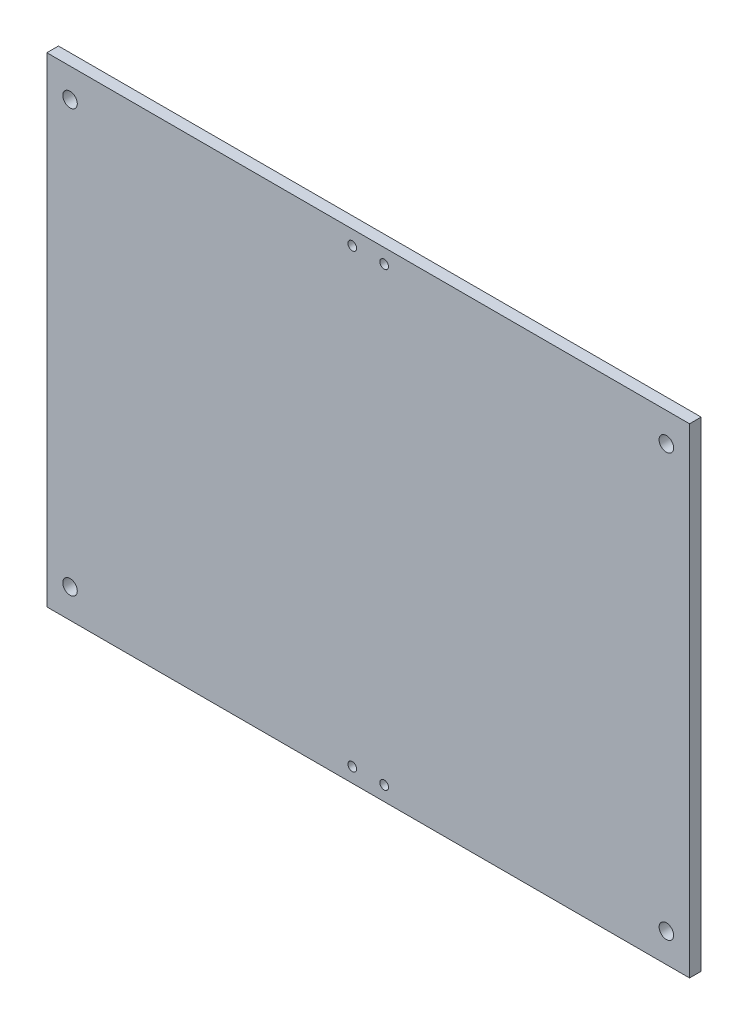
ISO-10303-21;
HEADER;
FILE_DESCRIPTION(('STEP AP214'),'2;1');
FILE_NAME('part.step','',(''),(''),'','','');
FILE_SCHEMA(('AUTOMOTIVE_DESIGN { 1 0 10303 214 1 1 1 1 }'));
ENDSEC;
DATA;
#1=APPLICATION_CONTEXT('core data for automotive mechanical design processes');
#2=APPLICATION_PROTOCOL_DEFINITION('international standard','automotive_design',2000,#1);
#3=PRODUCT_CONTEXT('',#1,'mechanical');
#4=PRODUCT('Part','Part','',(#3));
#5=PRODUCT_RELATED_PRODUCT_CATEGORY('part','',(#4));
#6=PRODUCT_DEFINITION_FORMATION('','',#4);
#7=PRODUCT_DEFINITION_CONTEXT('part definition',#1,'design');
#8=PRODUCT_DEFINITION('design','',#6,#7);
#9=PRODUCT_DEFINITION_SHAPE('','',#8);
#10=(LENGTH_UNIT() NAMED_UNIT(*) SI_UNIT(.MILLI.,.METRE.));
#11=(NAMED_UNIT(*) PLANE_ANGLE_UNIT() SI_UNIT($,.RADIAN.));
#12=(NAMED_UNIT(*) SI_UNIT($,.STERADIAN.) SOLID_ANGLE_UNIT());
#13=UNCERTAINTY_MEASURE_WITH_UNIT(LENGTH_MEASURE(1.E-05),#10,'distance_accuracy_value','');
#14=(GEOMETRIC_REPRESENTATION_CONTEXT(3) GLOBAL_UNCERTAINTY_ASSIGNED_CONTEXT((#13)) GLOBAL_UNIT_ASSIGNED_CONTEXT((#10,
#11,#12)) REPRESENTATION_CONTEXT('',''));
#15=CARTESIAN_POINT('',(0.,0.,0.));
#16=DIRECTION('',(0.,0.,1.));
#17=DIRECTION('',(1.,0.,0.));
#18=AXIS2_PLACEMENT_3D('',#15,#16,#17);
#19=CARTESIAN_POINT('',(389.397540983607,431.475409836066,4.));
#20=DIRECTION('',(1.,0.,0.));
#21=DIRECTION('',(0.,0.,-1.));
#22=AXIS2_PLACEMENT_3D('',#19,#20,#21);
#23=PLANE('',#22);
#24=DIRECTION('',(0.,-1.,0.));
#25=VECTOR('',#24,1.);
#26=CARTESIAN_POINT('',(389.397540983607,431.475409836066,0.));
#27=LINE('',#26,#25);
#28=CARTESIAN_POINT('',(389.397540983607,431.475409836066,0.));
#29=VERTEX_POINT('',#28);
#30=CARTESIAN_POINT('',(389.397540983607,265.865409836066,0.));
#31=VERTEX_POINT('',#30);
#32=EDGE_CURVE('E99',#29,#31,#27,.T.);
#33=ORIENTED_EDGE('',*,*,#32,.T.);
#34=DIRECTION('',(0.,0.,-1.));
#35=VECTOR('',#34,1.);
#36=CARTESIAN_POINT('',(389.397540983607,265.865409836066,4.));
#37=LINE('',#36,#35);
#38=CARTESIAN_POINT('',(389.397540983607,265.865409836066,4.));
#39=VERTEX_POINT('',#38);
#40=EDGE_CURVE('E11',#39,#31,#37,.T.);
#41=ORIENTED_EDGE('',*,*,#40,.F.);
#42=DIRECTION('',(0.,-1.,0.));
#43=VECTOR('',#42,1.);
#44=CARTESIAN_POINT('',(389.397540983607,431.475409836066,4.));
#45=LINE('',#44,#43);
#46=CARTESIAN_POINT('',(389.397540983607,431.475409836066,4.));
#47=VERTEX_POINT('',#46);
#48=EDGE_CURVE('E86',#47,#39,#45,.T.);
#49=ORIENTED_EDGE('',*,*,#48,.F.);
#50=DIRECTION('',(0.,0.,-1.));
#51=VECTOR('',#50,1.);
#52=CARTESIAN_POINT('',(389.397540983607,431.475409836066,4.));
#53=LINE('',#52,#51);
#54=EDGE_CURVE('E95',#47,#29,#53,.T.);
#55=ORIENTED_EDGE('',*,*,#54,.T.);
#56=EDGE_LOOP('',(#33,#41,#49,#55));
#57=FACE_BOUND('',#56,.T.);
#58=ADVANCED_FACE('F33',(#57),#23,.F.);
#59=CARTESIAN_POINT('',(389.397540983607,265.865409836066,4.));
#60=DIRECTION('',(0.,1.,0.));
#61=DIRECTION('',(0.,0.,1.));
#62=AXIS2_PLACEMENT_3D('',#59,#60,#61);
#63=PLANE('',#62);
#64=DIRECTION('',(1.,0.,0.));
#65=VECTOR('',#64,1.);
#66=CARTESIAN_POINT('',(389.397540983607,265.865409836066,0.));
#67=LINE('',#66,#65);
#68=CARTESIAN_POINT('',(611.147540983607,265.865409836066,0.));
#69=VERTEX_POINT('',#68);
#70=EDGE_CURVE('E90',#31,#69,#67,.T.);
#71=ORIENTED_EDGE('',*,*,#70,.T.);
#72=DIRECTION('',(0.,0.,-1.));
#73=VECTOR('',#72,1.);
#74=CARTESIAN_POINT('',(611.147540983607,265.865409836066,4.));
#75=LINE('',#74,#73);
#76=CARTESIAN_POINT('',(611.147540983607,265.865409836066,4.));
#77=VERTEX_POINT('',#76);
#78=EDGE_CURVE('E42',#77,#69,#75,.T.);
#79=ORIENTED_EDGE('',*,*,#78,.F.);
#80=DIRECTION('',(1.,0.,0.));
#81=VECTOR('',#80,1.);
#82=CARTESIAN_POINT('',(389.397540983607,265.865409836066,4.));
#83=LINE('',#82,#81);
#84=EDGE_CURVE('E81',#39,#77,#83,.T.);
#85=ORIENTED_EDGE('',*,*,#84,.F.);
#86=ORIENTED_EDGE('',*,*,#40,.T.);
#87=EDGE_LOOP('',(#71,#79,#85,#86));
#88=FACE_BOUND('',#87,.T.);
#89=ADVANCED_FACE('F89',(#88),#63,.F.);
#90=CARTESIAN_POINT('',(611.147540983607,431.475409836066,4.));
#91=DIRECTION('',(-1.,0.,0.));
#92=DIRECTION('',(0.,-1.,0.));
#93=AXIS2_PLACEMENT_3D('',#90,#91,#92);
#94=PLANE('',#93);
#95=DIRECTION('',(0.,1.,0.));
#96=VECTOR('',#95,1.);
#97=CARTESIAN_POINT('',(611.147540983607,431.475409836066,0.));
#98=LINE('',#97,#96);
#99=CARTESIAN_POINT('',(611.147540983607,431.475409836066,0.));
#100=VERTEX_POINT('',#99);
#101=EDGE_CURVE('E68',#69,#100,#98,.T.);
#102=ORIENTED_EDGE('',*,*,#101,.T.);
#103=DIRECTION('',(0.,0.,-1.));
#104=VECTOR('',#103,1.);
#105=CARTESIAN_POINT('',(611.147540983607,431.475409836066,4.));
#106=LINE('',#105,#104);
#107=CARTESIAN_POINT('',(611.147540983607,431.475409836066,4.));
#108=VERTEX_POINT('',#107);
#109=EDGE_CURVE('E91',#108,#100,#106,.T.);
#110=ORIENTED_EDGE('',*,*,#109,.F.);
#111=DIRECTION('',(0.,1.,0.));
#112=VECTOR('',#111,1.);
#113=CARTESIAN_POINT('',(611.147540983607,431.475409836066,4.));
#114=LINE('',#113,#112);
#115=EDGE_CURVE('E84',#77,#108,#114,.T.);
#116=ORIENTED_EDGE('',*,*,#115,.F.);
#117=ORIENTED_EDGE('',*,*,#78,.T.);
#118=EDGE_LOOP('',(#102,#110,#116,#117));
#119=FACE_BOUND('',#118,.T.);
#120=ADVANCED_FACE('F93',(#119),#94,.F.);
#121=CARTESIAN_POINT('',(389.397540983607,431.475409836066,4.));
#122=DIRECTION('',(0.,-1.,0.));
#123=DIRECTION('',(0.,0.,-1.));
#124=AXIS2_PLACEMENT_3D('',#121,#122,#123);
#125=PLANE('',#124);
#126=DIRECTION('',(-1.,0.,0.));
#127=VECTOR('',#126,1.);
#128=CARTESIAN_POINT('',(389.397540983607,431.475409836066,0.));
#129=LINE('',#128,#127);
#130=EDGE_CURVE('E74',#100,#29,#129,.T.);
#131=ORIENTED_EDGE('',*,*,#130,.T.);
#132=ORIENTED_EDGE('',*,*,#54,.F.);
#133=DIRECTION('',(-1.,0.,0.));
#134=VECTOR('',#133,1.);
#135=CARTESIAN_POINT('',(389.397540983607,431.475409836066,4.));
#136=LINE('',#135,#134);
#137=EDGE_CURVE('E51',#108,#47,#136,.T.);
#138=ORIENTED_EDGE('',*,*,#137,.F.);
#139=ORIENTED_EDGE('',*,*,#109,.T.);
#140=EDGE_LOOP('',(#131,#132,#138,#139));
#141=FACE_BOUND('',#140,.T.);
#142=ADVANCED_FACE('F160',(#141),#125,.F.);
#143=CARTESIAN_POINT('',(0.,0.,4.));
#144=DIRECTION('',(0.,0.,1.));
#145=DIRECTION('',(1.,0.,0.));
#146=AXIS2_PLACEMENT_3D('',#143,#144,#145);
#147=PLANE('',#146);
#148=CARTESIAN_POINT('',(505.772540983607,426.475409836066,4.));
#149=DIRECTION('',(0.,0.,1.));
#150=DIRECTION('',(1.,0.,0.));
#151=AXIS2_PLACEMENT_3D('',#148,#149,#150);
#152=CIRCLE('',#151,1.49999999999997);
#153=CARTESIAN_POINT('',(507.272540983607,426.475409836066,4.));
#154=VERTEX_POINT('',#153);
#155=EDGE_CURVE('E128',#154,#154,#152,.T.);
#156=ORIENTED_EDGE('',*,*,#155,.F.);
#157=EDGE_LOOP('',(#156));
#158=FACE_BOUND('',#157,.T.);
#159=CARTESIAN_POINT('',(494.772540983607,426.475409836066,4.));
#160=DIRECTION('',(0.,0.,1.));
#161=DIRECTION('',(1.,0.,0.));
#162=AXIS2_PLACEMENT_3D('',#159,#160,#161);
#163=CIRCLE('',#162,1.49999999999997);
#164=CARTESIAN_POINT('',(496.272540983607,426.475409836066,4.));
#165=VERTEX_POINT('',#164);
#166=EDGE_CURVE('E118',#165,#165,#163,.T.);
#167=ORIENTED_EDGE('',*,*,#166,.F.);
#168=EDGE_LOOP('',(#167));
#169=FACE_BOUND('',#168,.T.);
#170=CARTESIAN_POINT('',(505.772540983607,270.865409836066,4.));
#171=DIRECTION('',(0.,0.,1.));
#172=DIRECTION('',(1.,0.,0.));
#173=AXIS2_PLACEMENT_3D('',#170,#171,#172);
#174=CIRCLE('',#173,1.49999999999997);
#175=CARTESIAN_POINT('',(507.272540983607,270.865409836066,4.));
#176=VERTEX_POINT('',#175);
#177=EDGE_CURVE('E115',#176,#176,#174,.T.);
#178=ORIENTED_EDGE('',*,*,#177,.F.);
#179=EDGE_LOOP('',(#178));
#180=FACE_BOUND('',#179,.T.);
#181=CARTESIAN_POINT('',(494.772540983607,270.865409836066,4.));
#182=DIRECTION('',(0.,0.,1.));
#183=DIRECTION('',(1.,0.,0.));
#184=AXIS2_PLACEMENT_3D('',#181,#182,#183);
#185=CIRCLE('',#184,1.50000000000008);
#186=CARTESIAN_POINT('',(496.272540983607,270.865409836066,4.));
#187=VERTEX_POINT('',#186);
#188=EDGE_CURVE('E112',#187,#187,#185,.T.);
#189=ORIENTED_EDGE('',*,*,#188,.F.);
#190=EDGE_LOOP('',(#189));
#191=FACE_BOUND('',#190,.T.);
#192=CARTESIAN_POINT('',(397.397540983607,275.865409836066,4.));
#193=DIRECTION('',(0.,0.,1.));
#194=DIRECTION('',(1.,0.,0.));
#195=AXIS2_PLACEMENT_3D('',#192,#193,#194);
#196=CIRCLE('',#195,2.4999999999999);
#197=CARTESIAN_POINT('',(399.897540983607,275.865409836066,4.));
#198=VERTEX_POINT('',#197);
#199=EDGE_CURVE('E111',#198,#198,#196,.T.);
#200=ORIENTED_EDGE('',*,*,#199,.F.);
#201=EDGE_LOOP('',(#200));
#202=FACE_BOUND('',#201,.T.);
#203=CARTESIAN_POINT('',(603.147540983607,275.865409836066,4.));
#204=DIRECTION('',(0.,0.,1.));
#205=DIRECTION('',(1.,0.,0.));
#206=AXIS2_PLACEMENT_3D('',#203,#204,#205);
#207=CIRCLE('',#206,2.49999999999992);
#208=CARTESIAN_POINT('',(605.647540983607,275.865409836066,4.));
#209=VERTEX_POINT('',#208);
#210=EDGE_CURVE('E136',#209,#209,#207,.T.);
#211=ORIENTED_EDGE('',*,*,#210,.F.);
#212=EDGE_LOOP('',(#211));
#213=FACE_BOUND('',#212,.T.);
#214=CARTESIAN_POINT('',(603.147540983607,421.475409836066,4.));
#215=DIRECTION('',(0.,0.,1.));
#216=DIRECTION('',(1.,0.,0.));
#217=AXIS2_PLACEMENT_3D('',#214,#215,#216);
#218=CIRCLE('',#217,2.49999999999992);
#219=CARTESIAN_POINT('',(605.647540983607,421.475409836066,4.));
#220=VERTEX_POINT('',#219);
#221=EDGE_CURVE('E142',#220,#220,#218,.T.);
#222=ORIENTED_EDGE('',*,*,#221,.F.);
#223=EDGE_LOOP('',(#222));
#224=FACE_BOUND('',#223,.T.);
#225=CARTESIAN_POINT('',(397.397540983607,421.475409836066,4.));
#226=DIRECTION('',(0.,0.,1.));
#227=DIRECTION('',(1.,0.,0.));
#228=AXIS2_PLACEMENT_3D('',#225,#226,#227);
#229=CIRCLE('',#228,2.4999999999999);
#230=CARTESIAN_POINT('',(399.897540983607,421.475409836066,4.));
#231=VERTEX_POINT('',#230);
#232=EDGE_CURVE('E148',#231,#231,#229,.T.);
#233=ORIENTED_EDGE('',*,*,#232,.F.);
#234=EDGE_LOOP('',(#233));
#235=FACE_BOUND('',#234,.T.);
#236=ORIENTED_EDGE('',*,*,#48,.T.);
#237=ORIENTED_EDGE('',*,*,#84,.T.);
#238=ORIENTED_EDGE('',*,*,#115,.T.);
#239=ORIENTED_EDGE('',*,*,#137,.T.);
#240=EDGE_LOOP('',(#236,#237,#238,#239));
#241=FACE_BOUND('',#240,.T.);
#242=ADVANCED_FACE('F82',(#158,#169,#180,#191,#202,#213,#224,#235,#241),#147,.T.);
#243=CARTESIAN_POINT('',(0.,0.,0.));
#244=DIRECTION('',(0.,0.,1.));
#245=DIRECTION('',(1.,0.,0.));
#246=AXIS2_PLACEMENT_3D('',#243,#244,#245);
#247=PLANE('',#246);
#248=CARTESIAN_POINT('',(505.772540983607,426.475409836066,0.));
#249=DIRECTION('',(0.,0.,1.));
#250=DIRECTION('',(1.,0.,0.));
#251=AXIS2_PLACEMENT_3D('',#248,#249,#250);
#252=CIRCLE('',#251,1.49999999999997);
#253=CARTESIAN_POINT('',(507.272540983607,426.475409836066,0.));
#254=VERTEX_POINT('',#253);
#255=EDGE_CURVE('E36',#254,#254,#252,.T.);
#256=ORIENTED_EDGE('',*,*,#255,.T.);
#257=EDGE_LOOP('',(#256));
#258=FACE_BOUND('',#257,.T.);
#259=CARTESIAN_POINT('',(494.772540983607,426.475409836066,0.));
#260=DIRECTION('',(0.,0.,1.));
#261=DIRECTION('',(1.,0.,0.));
#262=AXIS2_PLACEMENT_3D('',#259,#260,#261);
#263=CIRCLE('',#262,1.49999999999997);
#264=CARTESIAN_POINT('',(496.272540983607,426.475409836066,0.));
#265=VERTEX_POINT('',#264);
#266=EDGE_CURVE('E116',#265,#265,#263,.T.);
#267=ORIENTED_EDGE('',*,*,#266,.T.);
#268=EDGE_LOOP('',(#267));
#269=FACE_BOUND('',#268,.T.);
#270=CARTESIAN_POINT('',(505.772540983607,270.865409836066,0.));
#271=DIRECTION('',(0.,0.,1.));
#272=DIRECTION('',(1.,0.,0.));
#273=AXIS2_PLACEMENT_3D('',#270,#271,#272);
#274=CIRCLE('',#273,1.49999999999997);
#275=CARTESIAN_POINT('',(507.272540983607,270.865409836066,0.));
#276=VERTEX_POINT('',#275);
#277=EDGE_CURVE('E113',#276,#276,#274,.T.);
#278=ORIENTED_EDGE('',*,*,#277,.T.);
#279=EDGE_LOOP('',(#278));
#280=FACE_BOUND('',#279,.T.);
#281=CARTESIAN_POINT('',(494.772540983607,270.865409836066,0.));
#282=DIRECTION('',(0.,0.,1.));
#283=DIRECTION('',(1.,0.,0.));
#284=AXIS2_PLACEMENT_3D('',#281,#282,#283);
#285=CIRCLE('',#284,1.50000000000008);
#286=CARTESIAN_POINT('',(496.272540983607,270.865409836066,0.));
#287=VERTEX_POINT('',#286);
#288=EDGE_CURVE('E108',#287,#287,#285,.T.);
#289=ORIENTED_EDGE('',*,*,#288,.T.);
#290=EDGE_LOOP('',(#289));
#291=FACE_BOUND('',#290,.T.);
#292=CARTESIAN_POINT('',(397.397540983607,275.865409836066,0.));
#293=DIRECTION('',(0.,0.,1.));
#294=DIRECTION('',(1.,0.,0.));
#295=AXIS2_PLACEMENT_3D('',#292,#293,#294);
#296=CIRCLE('',#295,2.4999999999999);
#297=CARTESIAN_POINT('',(399.897540983607,275.865409836066,0.));
#298=VERTEX_POINT('',#297);
#299=EDGE_CURVE('E133',#298,#298,#296,.T.);
#300=ORIENTED_EDGE('',*,*,#299,.T.);
#301=EDGE_LOOP('',(#300));
#302=FACE_BOUND('',#301,.T.);
#303=CARTESIAN_POINT('',(603.147540983607,275.865409836066,0.));
#304=DIRECTION('',(0.,0.,1.));
#305=DIRECTION('',(1.,0.,0.));
#306=AXIS2_PLACEMENT_3D('',#303,#304,#305);
#307=CIRCLE('',#306,2.49999999999992);
#308=CARTESIAN_POINT('',(605.647540983607,275.865409836066,0.));
#309=VERTEX_POINT('',#308);
#310=EDGE_CURVE('E139',#309,#309,#307,.T.);
#311=ORIENTED_EDGE('',*,*,#310,.T.);
#312=EDGE_LOOP('',(#311));
#313=FACE_BOUND('',#312,.T.);
#314=CARTESIAN_POINT('',(603.147540983607,421.475409836066,0.));
#315=DIRECTION('',(0.,0.,1.));
#316=DIRECTION('',(1.,0.,0.));
#317=AXIS2_PLACEMENT_3D('',#314,#315,#316);
#318=CIRCLE('',#317,2.49999999999992);
#319=CARTESIAN_POINT('',(605.647540983607,421.475409836066,0.));
#320=VERTEX_POINT('',#319);
#321=EDGE_CURVE('E145',#320,#320,#318,.T.);
#322=ORIENTED_EDGE('',*,*,#321,.T.);
#323=EDGE_LOOP('',(#322));
#324=FACE_BOUND('',#323,.T.);
#325=CARTESIAN_POINT('',(397.397540983607,421.475409836066,0.));
#326=DIRECTION('',(0.,0.,1.));
#327=DIRECTION('',(1.,0.,0.));
#328=AXIS2_PLACEMENT_3D('',#325,#326,#327);
#329=CIRCLE('',#328,2.4999999999999);
#330=CARTESIAN_POINT('',(399.897540983607,421.475409836066,0.));
#331=VERTEX_POINT('',#330);
#332=EDGE_CURVE('E102',#331,#331,#329,.T.);
#333=ORIENTED_EDGE('',*,*,#332,.T.);
#334=EDGE_LOOP('',(#333));
#335=FACE_BOUND('',#334,.T.);
#336=ORIENTED_EDGE('',*,*,#32,.F.);
#337=ORIENTED_EDGE('',*,*,#130,.F.);
#338=ORIENTED_EDGE('',*,*,#101,.F.);
#339=ORIENTED_EDGE('',*,*,#70,.F.);
#340=EDGE_LOOP('',(#336,#337,#338,#339));
#341=FACE_BOUND('',#340,.T.);
#342=ADVANCED_FACE('F159',(#258,#269,#280,#291,#302,#313,#324,#335,#341),#247,.F.);
#343=CARTESIAN_POINT('',(397.397540983607,421.475409836066,0.));
#344=DIRECTION('',(0.,0.,1.));
#345=DIRECTION('',(1.,0.,0.));
#346=AXIS2_PLACEMENT_3D('',#343,#344,#345);
#347=CYLINDRICAL_SURFACE('',#346,2.4999999999999);
#348=ORIENTED_EDGE('',*,*,#332,.F.);
#349=EDGE_LOOP('',(#348));
#350=FACE_BOUND('',#349,.T.);
#351=ORIENTED_EDGE('',*,*,#232,.T.);
#352=EDGE_LOOP('',(#351));
#353=FACE_BOUND('',#352,.T.);
#354=ADVANCED_FACE('F156',(#350,#353),#347,.F.);
#355=CARTESIAN_POINT('',(603.147540983607,421.475409836066,0.));
#356=DIRECTION('',(0.,0.,1.));
#357=DIRECTION('',(1.,0.,0.));
#358=AXIS2_PLACEMENT_3D('',#355,#356,#357);
#359=CYLINDRICAL_SURFACE('',#358,2.49999999999992);
#360=ORIENTED_EDGE('',*,*,#321,.F.);
#361=EDGE_LOOP('',(#360));
#362=FACE_BOUND('',#361,.T.);
#363=ORIENTED_EDGE('',*,*,#221,.T.);
#364=EDGE_LOOP('',(#363));
#365=FACE_BOUND('',#364,.T.);
#366=ADVANCED_FACE('F200',(#362,#365),#359,.F.);
#367=CARTESIAN_POINT('',(603.147540983607,275.865409836066,0.));
#368=DIRECTION('',(0.,0.,1.));
#369=DIRECTION('',(1.,0.,0.));
#370=AXIS2_PLACEMENT_3D('',#367,#368,#369);
#371=CYLINDRICAL_SURFACE('',#370,2.49999999999992);
#372=ORIENTED_EDGE('',*,*,#310,.F.);
#373=EDGE_LOOP('',(#372));
#374=FACE_BOUND('',#373,.T.);
#375=ORIENTED_EDGE('',*,*,#210,.T.);
#376=EDGE_LOOP('',(#375));
#377=FACE_BOUND('',#376,.T.);
#378=ADVANCED_FACE('F210',(#374,#377),#371,.F.);
#379=CARTESIAN_POINT('',(397.397540983607,275.865409836066,0.));
#380=DIRECTION('',(0.,0.,1.));
#381=DIRECTION('',(1.,0.,0.));
#382=AXIS2_PLACEMENT_3D('',#379,#380,#381);
#383=CYLINDRICAL_SURFACE('',#382,2.4999999999999);
#384=ORIENTED_EDGE('',*,*,#299,.F.);
#385=EDGE_LOOP('',(#384));
#386=FACE_BOUND('',#385,.T.);
#387=ORIENTED_EDGE('',*,*,#199,.T.);
#388=EDGE_LOOP('',(#387));
#389=FACE_BOUND('',#388,.T.);
#390=ADVANCED_FACE('F220',(#386,#389),#383,.F.);
#391=CARTESIAN_POINT('',(494.772540983607,270.865409836066,-6.));
#392=DIRECTION('',(0.,0.,1.));
#393=DIRECTION('',(1.,0.,0.));
#394=AXIS2_PLACEMENT_3D('',#391,#392,#393);
#395=CYLINDRICAL_SURFACE('',#394,1.50000000000008);
#396=ORIENTED_EDGE('',*,*,#188,.T.);
#397=EDGE_LOOP('',(#396));
#398=FACE_BOUND('',#397,.T.);
#399=ORIENTED_EDGE('',*,*,#288,.F.);
#400=EDGE_LOOP('',(#399));
#401=FACE_BOUND('',#400,.T.);
#402=ADVANCED_FACE('F229',(#398,#401),#395,.F.);
#403=CARTESIAN_POINT('',(505.772540983607,270.865409836066,-6.));
#404=DIRECTION('',(0.,0.,1.));
#405=DIRECTION('',(1.,0.,0.));
#406=AXIS2_PLACEMENT_3D('',#403,#404,#405);
#407=CYLINDRICAL_SURFACE('',#406,1.49999999999997);
#408=ORIENTED_EDGE('',*,*,#177,.T.);
#409=EDGE_LOOP('',(#408));
#410=FACE_BOUND('',#409,.T.);
#411=ORIENTED_EDGE('',*,*,#277,.F.);
#412=EDGE_LOOP('',(#411));
#413=FACE_BOUND('',#412,.T.);
#414=ADVANCED_FACE('F248',(#410,#413),#407,.F.);
#415=CARTESIAN_POINT('',(494.772540983607,426.475409836066,-6.));
#416=DIRECTION('',(0.,0.,1.));
#417=DIRECTION('',(1.,0.,0.));
#418=AXIS2_PLACEMENT_3D('',#415,#416,#417);
#419=CYLINDRICAL_SURFACE('',#418,1.49999999999997);
#420=ORIENTED_EDGE('',*,*,#166,.T.);
#421=EDGE_LOOP('',(#420));
#422=FACE_BOUND('',#421,.T.);
#423=ORIENTED_EDGE('',*,*,#266,.F.);
#424=EDGE_LOOP('',(#423));
#425=FACE_BOUND('',#424,.T.);
#426=ADVANCED_FACE('F258',(#422,#425),#419,.F.);
#427=CARTESIAN_POINT('',(505.772540983607,426.475409836066,-6.));
#428=DIRECTION('',(0.,0.,1.));
#429=DIRECTION('',(1.,0.,0.));
#430=AXIS2_PLACEMENT_3D('',#427,#428,#429);
#431=CYLINDRICAL_SURFACE('',#430,1.49999999999997);
#432=ORIENTED_EDGE('',*,*,#155,.T.);
#433=EDGE_LOOP('',(#432));
#434=FACE_BOUND('',#433,.T.);
#435=ORIENTED_EDGE('',*,*,#255,.F.);
#436=EDGE_LOOP('',(#435));
#437=FACE_BOUND('',#436,.T.);
#438=ADVANCED_FACE('F268',(#434,#437),#431,.F.);
#439=CLOSED_SHELL('',(#58,#89,#120,#142,#242,#342,#354,#366,#378,#390,#402,#414,#426,#438));
#440=MANIFOLD_SOLID_BREP('B2',#439);
#441=ADVANCED_BREP_SHAPE_REPRESENTATION('',(#18,#440),#14);
#442=SHAPE_DEFINITION_REPRESENTATION(#9,#441);
ENDSEC;
END-ISO-10303-21;
